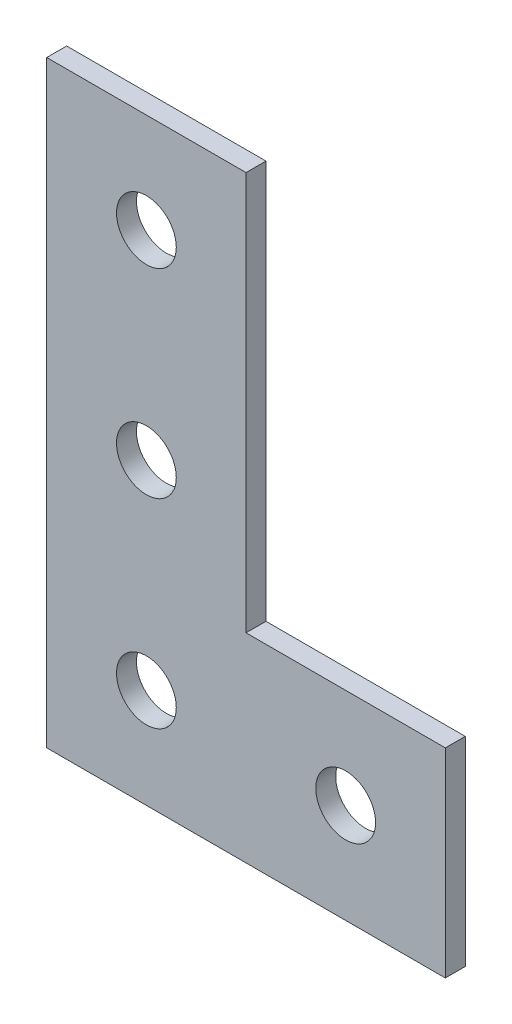
ISO-10303-21;
HEADER;
FILE_DESCRIPTION(('STEP AP214'),'2;1');
FILE_NAME('part.step','',(''),(''),'','','');
FILE_SCHEMA(('AUTOMOTIVE_DESIGN { 1 0 10303 214 1 1 1 1 }'));
ENDSEC;
DATA;
#1=APPLICATION_CONTEXT('core data for automotive mechanical design processes');
#2=APPLICATION_PROTOCOL_DEFINITION('international standard','automotive_design',2000,#1);
#3=PRODUCT_CONTEXT('',#1,'mechanical');
#4=PRODUCT('Part','Part','',(#3));
#5=PRODUCT_RELATED_PRODUCT_CATEGORY('part','',(#4));
#6=PRODUCT_DEFINITION_FORMATION('','',#4);
#7=PRODUCT_DEFINITION_CONTEXT('part definition',#1,'design');
#8=PRODUCT_DEFINITION('design','',#6,#7);
#9=PRODUCT_DEFINITION_SHAPE('','',#8);
#10=(LENGTH_UNIT() NAMED_UNIT(*) SI_UNIT(.MILLI.,.METRE.));
#11=(NAMED_UNIT(*) PLANE_ANGLE_UNIT() SI_UNIT($,.RADIAN.));
#12=(NAMED_UNIT(*) SI_UNIT($,.STERADIAN.) SOLID_ANGLE_UNIT());
#13=UNCERTAINTY_MEASURE_WITH_UNIT(LENGTH_MEASURE(1.E-05),#10,'distance_accuracy_value','');
#14=(GEOMETRIC_REPRESENTATION_CONTEXT(3) GLOBAL_UNCERTAINTY_ASSIGNED_CONTEXT((#13)) GLOBAL_UNIT_ASSIGNED_CONTEXT((#10,
#11,#12)) REPRESENTATION_CONTEXT('',''));
#15=CARTESIAN_POINT('',(0.,0.,0.));
#16=DIRECTION('',(0.,0.,1.));
#17=DIRECTION('',(1.,0.,0.));
#18=AXIS2_PLACEMENT_3D('',#15,#16,#17);
#19=CARTESIAN_POINT('',(0.,30.,1.));
#20=DIRECTION('',(1.,0.,0.));
#21=DIRECTION('',(0.,0.,-1.));
#22=AXIS2_PLACEMENT_3D('',#19,#20,#21);
#23=PLANE('',#22);
#24=DIRECTION('',(0.,-1.,0.));
#25=VECTOR('',#24,1.);
#26=CARTESIAN_POINT('',(0.,30.,0.));
#27=LINE('',#26,#25);
#28=CARTESIAN_POINT('',(0.,30.,0.));
#29=VERTEX_POINT('',#28);
#30=CARTESIAN_POINT('',(0.,0.,0.));
#31=VERTEX_POINT('',#30);
#32=EDGE_CURVE('E117',#29,#31,#27,.T.);
#33=ORIENTED_EDGE('',*,*,#32,.T.);
#34=DIRECTION('',(0.,0.,-1.));
#35=VECTOR('',#34,1.);
#36=CARTESIAN_POINT('',(0.,0.,1.));
#37=LINE('',#36,#35);
#38=CARTESIAN_POINT('',(0.,0.,1.));
#39=VERTEX_POINT('',#38);
#40=EDGE_CURVE('E11',#39,#31,#37,.T.);
#41=ORIENTED_EDGE('',*,*,#40,.F.);
#42=DIRECTION('',(0.,-1.,0.));
#43=VECTOR('',#42,1.);
#44=CARTESIAN_POINT('',(0.,30.,1.));
#45=LINE('',#44,#43);
#46=CARTESIAN_POINT('',(0.,30.,1.));
#47=VERTEX_POINT('',#46);
#48=EDGE_CURVE('E128',#47,#39,#45,.T.);
#49=ORIENTED_EDGE('',*,*,#48,.F.);
#50=DIRECTION('',(0.,0.,-1.));
#51=VECTOR('',#50,1.);
#52=CARTESIAN_POINT('',(0.,30.,1.));
#53=LINE('',#52,#51);
#54=EDGE_CURVE('E113',#47,#29,#53,.T.);
#55=ORIENTED_EDGE('',*,*,#54,.T.);
#56=EDGE_LOOP('',(#33,#41,#49,#55));
#57=FACE_BOUND('',#56,.T.);
#58=ADVANCED_FACE('F33',(#57),#23,.F.);
#59=CARTESIAN_POINT('',(0.,0.,1.));
#60=DIRECTION('',(0.,1.,0.));
#61=DIRECTION('',(0.,0.,1.));
#62=AXIS2_PLACEMENT_3D('',#59,#60,#61);
#63=PLANE('',#62);
#64=DIRECTION('',(1.,0.,0.));
#65=VECTOR('',#64,1.);
#66=CARTESIAN_POINT('',(0.,0.,0.));
#67=LINE('',#66,#65);
#68=CARTESIAN_POINT('',(20.,0.,0.));
#69=VERTEX_POINT('',#68);
#70=EDGE_CURVE('E120',#31,#69,#67,.T.);
#71=ORIENTED_EDGE('',*,*,#70,.T.);
#72=DIRECTION('',(0.,0.,-1.));
#73=VECTOR('',#72,1.);
#74=CARTESIAN_POINT('',(20.,0.,1.));
#75=LINE('',#74,#73);
#76=CARTESIAN_POINT('',(20.,0.,1.));
#77=VERTEX_POINT('',#76);
#78=EDGE_CURVE('E41',#77,#69,#75,.T.);
#79=ORIENTED_EDGE('',*,*,#78,.F.);
#80=DIRECTION('',(1.,0.,0.));
#81=VECTOR('',#80,1.);
#82=CARTESIAN_POINT('',(0.,0.,1.));
#83=LINE('',#82,#81);
#84=EDGE_CURVE('E86',#39,#77,#83,.T.);
#85=ORIENTED_EDGE('',*,*,#84,.F.);
#86=ORIENTED_EDGE('',*,*,#40,.T.);
#87=EDGE_LOOP('',(#71,#79,#85,#86));
#88=FACE_BOUND('',#87,.T.);
#89=ADVANCED_FACE('F153',(#88),#63,.F.);
#90=CARTESIAN_POINT('',(20.,0.,1.));
#91=DIRECTION('',(-1.,0.,0.));
#92=DIRECTION('',(0.,0.,1.));
#93=AXIS2_PLACEMENT_3D('',#90,#91,#92);
#94=PLANE('',#93);
#95=DIRECTION('',(0.,1.,0.));
#96=VECTOR('',#95,1.);
#97=CARTESIAN_POINT('',(20.,0.,0.));
#98=LINE('',#97,#96);
#99=CARTESIAN_POINT('',(20.,10.,0.));
#100=VERTEX_POINT('',#99);
#101=EDGE_CURVE('E123',#69,#100,#98,.T.);
#102=ORIENTED_EDGE('',*,*,#101,.T.);
#103=DIRECTION('',(0.,0.,-1.));
#104=VECTOR('',#103,1.);
#105=CARTESIAN_POINT('',(20.,10.,1.));
#106=LINE('',#105,#104);
#107=CARTESIAN_POINT('',(20.,10.,1.));
#108=VERTEX_POINT('',#107);
#109=EDGE_CURVE('E108',#108,#100,#106,.T.);
#110=ORIENTED_EDGE('',*,*,#109,.F.);
#111=DIRECTION('',(0.,1.,0.));
#112=VECTOR('',#111,1.);
#113=CARTESIAN_POINT('',(20.,0.,1.));
#114=LINE('',#113,#112);
#115=EDGE_CURVE('E99',#77,#108,#114,.T.);
#116=ORIENTED_EDGE('',*,*,#115,.F.);
#117=ORIENTED_EDGE('',*,*,#78,.T.);
#118=EDGE_LOOP('',(#102,#110,#116,#117));
#119=FACE_BOUND('',#118,.T.);
#120=ADVANCED_FACE('F134',(#119),#94,.F.);
#121=CARTESIAN_POINT('',(20.,10.,1.));
#122=DIRECTION('',(0.,-1.,0.));
#123=DIRECTION('',(1.,0.,0.));
#124=AXIS2_PLACEMENT_3D('',#121,#122,#123);
#125=PLANE('',#124);
#126=DIRECTION('',(-1.,0.,0.));
#127=VECTOR('',#126,1.);
#128=CARTESIAN_POINT('',(20.,10.,0.));
#129=LINE('',#128,#127);
#130=CARTESIAN_POINT('',(10.,10.,0.));
#131=VERTEX_POINT('',#130);
#132=EDGE_CURVE('E107',#100,#131,#129,.T.);
#133=ORIENTED_EDGE('',*,*,#132,.T.);
#134=DIRECTION('',(0.,0.,-1.));
#135=VECTOR('',#134,1.);
#136=CARTESIAN_POINT('',(10.,10.,1.));
#137=LINE('',#136,#135);
#138=CARTESIAN_POINT('',(10.,10.,1.));
#139=VERTEX_POINT('',#138);
#140=EDGE_CURVE('E104',#139,#131,#137,.T.);
#141=ORIENTED_EDGE('',*,*,#140,.F.);
#142=DIRECTION('',(-1.,0.,0.));
#143=VECTOR('',#142,1.);
#144=CARTESIAN_POINT('',(20.,10.,1.));
#145=LINE('',#144,#143);
#146=EDGE_CURVE('E93',#108,#139,#145,.T.);
#147=ORIENTED_EDGE('',*,*,#146,.F.);
#148=ORIENTED_EDGE('',*,*,#109,.T.);
#149=EDGE_LOOP('',(#133,#141,#147,#148));
#150=FACE_BOUND('',#149,.T.);
#151=ADVANCED_FACE('F105',(#150),#125,.F.);
#152=CARTESIAN_POINT('',(10.,10.,1.));
#153=DIRECTION('',(-1.,0.,0.));
#154=DIRECTION('',(0.,0.,1.));
#155=AXIS2_PLACEMENT_3D('',#152,#153,#154);
#156=PLANE('',#155);
#157=DIRECTION('',(0.,1.,0.));
#158=VECTOR('',#157,1.);
#159=CARTESIAN_POINT('',(10.,10.,0.));
#160=LINE('',#159,#158);
#161=CARTESIAN_POINT('',(10.,30.,0.));
#162=VERTEX_POINT('',#161);
#163=EDGE_CURVE('E72',#131,#162,#160,.T.);
#164=ORIENTED_EDGE('',*,*,#163,.T.);
#165=DIRECTION('',(0.,0.,-1.));
#166=VECTOR('',#165,1.);
#167=CARTESIAN_POINT('',(10.,30.,1.));
#168=LINE('',#167,#166);
#169=CARTESIAN_POINT('',(10.,30.,1.));
#170=VERTEX_POINT('',#169);
#171=EDGE_CURVE('E109',#170,#162,#168,.T.);
#172=ORIENTED_EDGE('',*,*,#171,.F.);
#173=DIRECTION('',(0.,1.,0.));
#174=VECTOR('',#173,1.);
#175=CARTESIAN_POINT('',(10.,10.,1.));
#176=LINE('',#175,#174);
#177=EDGE_CURVE('E97',#139,#170,#176,.T.);
#178=ORIENTED_EDGE('',*,*,#177,.F.);
#179=ORIENTED_EDGE('',*,*,#140,.T.);
#180=EDGE_LOOP('',(#164,#172,#178,#179));
#181=FACE_BOUND('',#180,.T.);
#182=ADVANCED_FACE('F111',(#181),#156,.F.);
#183=CARTESIAN_POINT('',(10.,30.,1.));
#184=DIRECTION('',(0.,-1.,0.));
#185=DIRECTION('',(0.,0.,-1.));
#186=AXIS2_PLACEMENT_3D('',#183,#184,#185);
#187=PLANE('',#186);
#188=DIRECTION('',(-1.,0.,0.));
#189=VECTOR('',#188,1.);
#190=CARTESIAN_POINT('',(10.,30.,0.));
#191=LINE('',#190,#189);
#192=EDGE_CURVE('E78',#162,#29,#191,.T.);
#193=ORIENTED_EDGE('',*,*,#192,.T.);
#194=ORIENTED_EDGE('',*,*,#54,.F.);
#195=DIRECTION('',(-1.,0.,0.));
#196=VECTOR('',#195,1.);
#197=CARTESIAN_POINT('',(10.,30.,1.));
#198=LINE('',#197,#196);
#199=EDGE_CURVE('E49',#170,#47,#198,.T.);
#200=ORIENTED_EDGE('',*,*,#199,.F.);
#201=ORIENTED_EDGE('',*,*,#171,.T.);
#202=EDGE_LOOP('',(#193,#194,#200,#201));
#203=FACE_BOUND('',#202,.T.);
#204=ADVANCED_FACE('F141',(#203),#187,.F.);
#205=CARTESIAN_POINT('',(0.,0.,1.));
#206=DIRECTION('',(0.,0.,1.));
#207=DIRECTION('',(1.,0.,0.));
#208=AXIS2_PLACEMENT_3D('',#205,#206,#207);
#209=PLANE('',#208);
#210=CARTESIAN_POINT('',(5.,25.,1.));
#211=DIRECTION('',(0.,0.,1.));
#212=DIRECTION('',(1.,0.,0.));
#213=AXIS2_PLACEMENT_3D('',#210,#211,#212);
#214=CIRCLE('',#213,1.5);
#215=CARTESIAN_POINT('',(6.5,25.,1.));
#216=VERTEX_POINT('',#215);
#217=EDGE_CURVE('E239',#216,#216,#214,.T.);
#218=ORIENTED_EDGE('',*,*,#217,.F.);
#219=EDGE_LOOP('',(#218));
#220=FACE_BOUND('',#219,.T.);
#221=CARTESIAN_POINT('',(5.,15.,1.));
#222=DIRECTION('',(0.,0.,1.));
#223=DIRECTION('',(1.,0.,0.));
#224=AXIS2_PLACEMENT_3D('',#221,#222,#223);
#225=CIRCLE('',#224,1.5);
#226=CARTESIAN_POINT('',(6.5,15.,1.));
#227=VERTEX_POINT('',#226);
#228=EDGE_CURVE('E245',#227,#227,#225,.T.);
#229=ORIENTED_EDGE('',*,*,#228,.F.);
#230=EDGE_LOOP('',(#229));
#231=FACE_BOUND('',#230,.T.);
#232=CARTESIAN_POINT('',(15.,5.,1.));
#233=DIRECTION('',(0.,0.,1.));
#234=DIRECTION('',(1.,0.,0.));
#235=AXIS2_PLACEMENT_3D('',#232,#233,#234);
#236=CIRCLE('',#235,1.5);
#237=CARTESIAN_POINT('',(16.5,5.,1.));
#238=VERTEX_POINT('',#237);
#239=EDGE_CURVE('E253',#238,#238,#236,.T.);
#240=ORIENTED_EDGE('',*,*,#239,.F.);
#241=EDGE_LOOP('',(#240));
#242=FACE_BOUND('',#241,.T.);
#243=CARTESIAN_POINT('',(5.,5.,1.));
#244=DIRECTION('',(0.,0.,1.));
#245=DIRECTION('',(1.,0.,0.));
#246=AXIS2_PLACEMENT_3D('',#243,#244,#245);
#247=CIRCLE('',#246,1.5);
#248=CARTESIAN_POINT('',(6.5,5.,1.));
#249=VERTEX_POINT('',#248);
#250=EDGE_CURVE('E242',#249,#249,#247,.T.);
#251=ORIENTED_EDGE('',*,*,#250,.F.);
#252=EDGE_LOOP('',(#251));
#253=FACE_BOUND('',#252,.T.);
#254=ORIENTED_EDGE('',*,*,#48,.T.);
#255=ORIENTED_EDGE('',*,*,#84,.T.);
#256=ORIENTED_EDGE('',*,*,#115,.T.);
#257=ORIENTED_EDGE('',*,*,#146,.T.);
#258=ORIENTED_EDGE('',*,*,#177,.T.);
#259=ORIENTED_EDGE('',*,*,#199,.T.);
#260=EDGE_LOOP('',(#254,#255,#256,#257,#258,#259));
#261=FACE_BOUND('',#260,.T.);
#262=ADVANCED_FACE('F95',(#220,#231,#242,#253,#261),#209,.T.);
#263=CARTESIAN_POINT('',(0.,0.,0.));
#264=DIRECTION('',(0.,0.,1.));
#265=DIRECTION('',(1.,0.,0.));
#266=AXIS2_PLACEMENT_3D('',#263,#264,#265);
#267=PLANE('',#266);
#268=CARTESIAN_POINT('',(5.,25.,0.));
#269=DIRECTION('',(0.,0.,1.));
#270=DIRECTION('',(1.,0.,0.));
#271=AXIS2_PLACEMENT_3D('',#268,#269,#270);
#272=CIRCLE('',#271,1.5);
#273=CARTESIAN_POINT('',(6.5,25.,0.));
#274=VERTEX_POINT('',#273);
#275=EDGE_CURVE('E236',#274,#274,#272,.T.);
#276=ORIENTED_EDGE('',*,*,#275,.T.);
#277=EDGE_LOOP('',(#276));
#278=FACE_BOUND('',#277,.T.);
#279=CARTESIAN_POINT('',(5.,15.,0.));
#280=DIRECTION('',(0.,0.,1.));
#281=DIRECTION('',(1.,0.,0.));
#282=AXIS2_PLACEMENT_3D('',#279,#280,#281);
#283=CIRCLE('',#282,1.5);
#284=CARTESIAN_POINT('',(6.5,15.,0.));
#285=VERTEX_POINT('',#284);
#286=EDGE_CURVE('E240',#285,#285,#283,.T.);
#287=ORIENTED_EDGE('',*,*,#286,.T.);
#288=EDGE_LOOP('',(#287));
#289=FACE_BOUND('',#288,.T.);
#290=CARTESIAN_POINT('',(15.,5.,0.));
#291=DIRECTION('',(0.,0.,1.));
#292=DIRECTION('',(1.,0.,0.));
#293=AXIS2_PLACEMENT_3D('',#290,#291,#292);
#294=CIRCLE('',#293,1.5);
#295=CARTESIAN_POINT('',(16.5,5.,0.));
#296=VERTEX_POINT('',#295);
#297=EDGE_CURVE('E250',#296,#296,#294,.T.);
#298=ORIENTED_EDGE('',*,*,#297,.T.);
#299=EDGE_LOOP('',(#298));
#300=FACE_BOUND('',#299,.T.);
#301=CARTESIAN_POINT('',(5.,5.,0.));
#302=DIRECTION('',(0.,0.,1.));
#303=DIRECTION('',(1.,0.,0.));
#304=AXIS2_PLACEMENT_3D('',#301,#302,#303);
#305=CIRCLE('',#304,1.5);
#306=CARTESIAN_POINT('',(6.5,5.,0.));
#307=VERTEX_POINT('',#306);
#308=EDGE_CURVE('E121',#307,#307,#305,.T.);
#309=ORIENTED_EDGE('',*,*,#308,.T.);
#310=EDGE_LOOP('',(#309));
#311=FACE_BOUND('',#310,.T.);
#312=ORIENTED_EDGE('',*,*,#32,.F.);
#313=ORIENTED_EDGE('',*,*,#192,.F.);
#314=ORIENTED_EDGE('',*,*,#163,.F.);
#315=ORIENTED_EDGE('',*,*,#132,.F.);
#316=ORIENTED_EDGE('',*,*,#101,.F.);
#317=ORIENTED_EDGE('',*,*,#70,.F.);
#318=EDGE_LOOP('',(#312,#313,#314,#315,#316,#317));
#319=FACE_BOUND('',#318,.T.);
#320=ADVANCED_FACE('F137',(#278,#289,#300,#311,#319),#267,.F.);
#321=CARTESIAN_POINT('',(5.,5.,0.));
#322=DIRECTION('',(0.,0.,1.));
#323=DIRECTION('',(1.,0.,0.));
#324=AXIS2_PLACEMENT_3D('',#321,#322,#323);
#325=CYLINDRICAL_SURFACE('',#324,1.5);
#326=ORIENTED_EDGE('',*,*,#308,.F.);
#327=EDGE_LOOP('',(#326));
#328=FACE_BOUND('',#327,.T.);
#329=ORIENTED_EDGE('',*,*,#250,.T.);
#330=EDGE_LOOP('',(#329));
#331=FACE_BOUND('',#330,.T.);
#332=ADVANCED_FACE('F190',(#328,#331),#325,.F.);
#333=CARTESIAN_POINT('',(15.,5.,0.));
#334=DIRECTION('',(0.,0.,1.));
#335=DIRECTION('',(1.,0.,0.));
#336=AXIS2_PLACEMENT_3D('',#333,#334,#335);
#337=CYLINDRICAL_SURFACE('',#336,1.5);
#338=ORIENTED_EDGE('',*,*,#297,.F.);
#339=EDGE_LOOP('',(#338));
#340=FACE_BOUND('',#339,.T.);
#341=ORIENTED_EDGE('',*,*,#239,.T.);
#342=EDGE_LOOP('',(#341));
#343=FACE_BOUND('',#342,.T.);
#344=ADVANCED_FACE('F199',(#340,#343),#337,.F.);
#345=CARTESIAN_POINT('',(5.,15.,0.));
#346=DIRECTION('',(0.,0.,1.));
#347=DIRECTION('',(1.,0.,0.));
#348=AXIS2_PLACEMENT_3D('',#345,#346,#347);
#349=CYLINDRICAL_SURFACE('',#348,1.5);
#350=ORIENTED_EDGE('',*,*,#286,.F.);
#351=EDGE_LOOP('',(#350));
#352=FACE_BOUND('',#351,.T.);
#353=ORIENTED_EDGE('',*,*,#228,.T.);
#354=EDGE_LOOP('',(#353));
#355=FACE_BOUND('',#354,.T.);
#356=ADVANCED_FACE('F209',(#352,#355),#349,.F.);
#357=CARTESIAN_POINT('',(5.,25.,0.));
#358=DIRECTION('',(0.,0.,1.));
#359=DIRECTION('',(1.,0.,0.));
#360=AXIS2_PLACEMENT_3D('',#357,#358,#359);
#361=CYLINDRICAL_SURFACE('',#360,1.5);
#362=ORIENTED_EDGE('',*,*,#275,.F.);
#363=EDGE_LOOP('',(#362));
#364=FACE_BOUND('',#363,.T.);
#365=ORIENTED_EDGE('',*,*,#217,.T.);
#366=EDGE_LOOP('',(#365));
#367=FACE_BOUND('',#366,.T.);
#368=ADVANCED_FACE('F219',(#364,#367),#361,.F.);
#369=CLOSED_SHELL('',(#58,#89,#120,#151,#182,#204,#262,#320,#332,#344,#356,#368));
#370=MANIFOLD_SOLID_BREP('B2',#369);
#371=ADVANCED_BREP_SHAPE_REPRESENTATION('',(#18,#370),#14);
#372=SHAPE_DEFINITION_REPRESENTATION(#9,#371);
ENDSEC;
END-ISO-10303-21;
